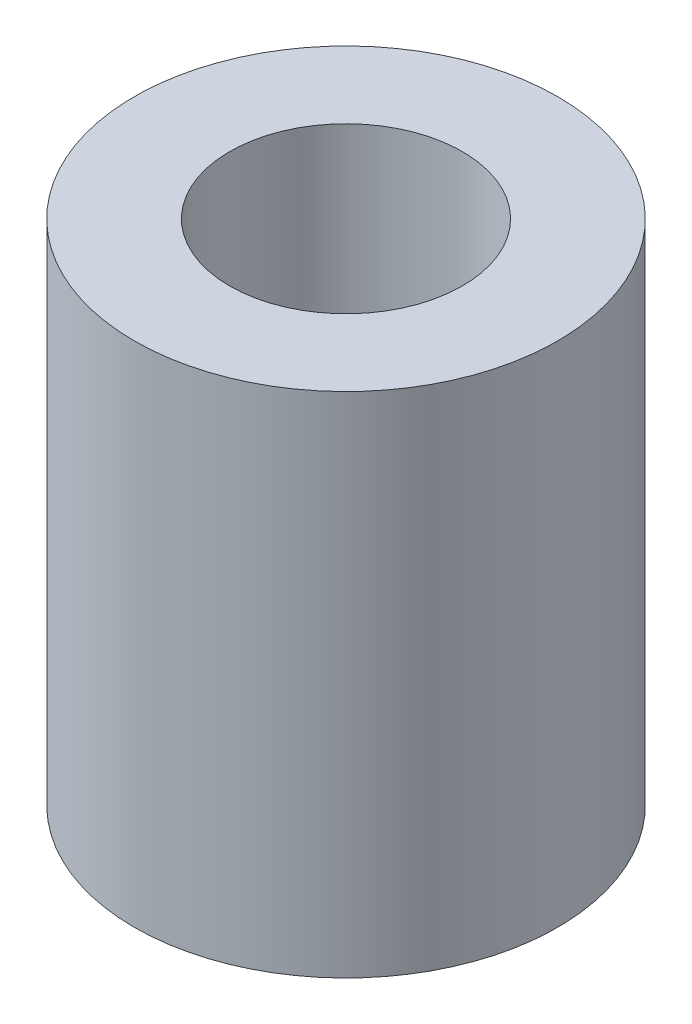
ISO-10303-21;
HEADER;
FILE_DESCRIPTION(('STEP AP214'),'2;1');
FILE_NAME('part.step','',(''),(''),'','','');
FILE_SCHEMA(('AUTOMOTIVE_DESIGN { 1 0 10303 214 1 1 1 1 }'));
ENDSEC;
DATA;
#1=APPLICATION_CONTEXT('core data for automotive mechanical design processes');
#2=APPLICATION_PROTOCOL_DEFINITION('international standard','automotive_design',2000,#1);
#3=PRODUCT_CONTEXT('',#1,'mechanical');
#4=PRODUCT('Part','Part','',(#3));
#5=PRODUCT_RELATED_PRODUCT_CATEGORY('part','',(#4));
#6=PRODUCT_DEFINITION_FORMATION('','',#4);
#7=PRODUCT_DEFINITION_CONTEXT('part definition',#1,'design');
#8=PRODUCT_DEFINITION('design','',#6,#7);
#9=PRODUCT_DEFINITION_SHAPE('','',#8);
#10=(LENGTH_UNIT() NAMED_UNIT(*) SI_UNIT(.MILLI.,.METRE.));
#11=(NAMED_UNIT(*) PLANE_ANGLE_UNIT() SI_UNIT($,.RADIAN.));
#12=(NAMED_UNIT(*) SI_UNIT($,.STERADIAN.) SOLID_ANGLE_UNIT());
#13=UNCERTAINTY_MEASURE_WITH_UNIT(LENGTH_MEASURE(1.E-05),#10,'distance_accuracy_value','');
#14=(GEOMETRIC_REPRESENTATION_CONTEXT(3) GLOBAL_UNCERTAINTY_ASSIGNED_CONTEXT((#13)) GLOBAL_UNIT_ASSIGNED_CONTEXT((#10,
#11,#12)) REPRESENTATION_CONTEXT('',''));
#15=CARTESIAN_POINT('',(0.,0.,0.));
#16=DIRECTION('',(0.,0.,1.));
#17=DIRECTION('',(1.,0.,0.));
#18=AXIS2_PLACEMENT_3D('',#15,#16,#17);
#19=CARTESIAN_POINT('',(0.,12.,0.));
#20=DIRECTION('',(0.,-1.,0.));
#21=DIRECTION('',(0.,0.,-1.));
#22=AXIS2_PLACEMENT_3D('',#19,#20,#21);
#23=CYLINDRICAL_SURFACE('',#22,5.);
#24=CARTESIAN_POINT('',(0.,12.,0.));
#25=DIRECTION('',(0.,1.,0.));
#26=DIRECTION('',(0.,0.,1.));
#27=AXIS2_PLACEMENT_3D('',#24,#25,#26);
#28=CIRCLE('',#27,5.);
#29=CARTESIAN_POINT('',(0.,12.,5.));
#30=VERTEX_POINT('',#29);
#31=EDGE_CURVE('E10',#30,#30,#28,.T.);
#32=ORIENTED_EDGE('',*,*,#31,.F.);
#33=EDGE_LOOP('',(#32));
#34=FACE_BOUND('',#33,.T.);
#35=CARTESIAN_POINT('',(0.,0.,0.));
#36=DIRECTION('',(0.,1.,0.));
#37=DIRECTION('',(0.,0.,1.));
#38=AXIS2_PLACEMENT_3D('',#35,#36,#37);
#39=CIRCLE('',#38,5.);
#40=CARTESIAN_POINT('',(0.,0.,5.));
#41=VERTEX_POINT('',#40);
#42=EDGE_CURVE('E32',#41,#41,#39,.T.);
#43=ORIENTED_EDGE('',*,*,#42,.T.);
#44=EDGE_LOOP('',(#43));
#45=FACE_BOUND('',#44,.T.);
#46=ADVANCED_FACE('F29',(#34,#45),#23,.T.);
#47=CARTESIAN_POINT('',(0.,12.,0.));
#48=DIRECTION('',(0.,1.,0.));
#49=DIRECTION('',(0.,0.,1.));
#50=AXIS2_PLACEMENT_3D('',#47,#48,#49);
#51=PLANE('',#50);
#52=CARTESIAN_POINT('',(0.,12.,0.));
#53=DIRECTION('',(0.,1.,0.));
#54=DIRECTION('',(0.,0.,1.));
#55=AXIS2_PLACEMENT_3D('',#52,#53,#54);
#56=CIRCLE('',#55,2.75);
#57=CARTESIAN_POINT('',(0.,12.,2.75));
#58=VERTEX_POINT('',#57);
#59=EDGE_CURVE('E41',#58,#58,#56,.T.);
#60=ORIENTED_EDGE('',*,*,#59,.F.);
#61=EDGE_LOOP('',(#60));
#62=FACE_BOUND('',#61,.T.);
#63=ORIENTED_EDGE('',*,*,#31,.T.);
#64=EDGE_LOOP('',(#63));
#65=FACE_BOUND('',#64,.T.);
#66=ADVANCED_FACE('F56',(#62,#65),#51,.T.);
#67=CARTESIAN_POINT('',(0.,0.,0.));
#68=DIRECTION('',(0.,1.,0.));
#69=DIRECTION('',(0.,0.,1.));
#70=AXIS2_PLACEMENT_3D('',#67,#68,#69);
#71=PLANE('',#70);
#72=CARTESIAN_POINT('',(0.,0.,0.));
#73=DIRECTION('',(0.,1.,0.));
#74=DIRECTION('',(0.,0.,1.));
#75=AXIS2_PLACEMENT_3D('',#72,#73,#74);
#76=CIRCLE('',#75,2.75);
#77=CARTESIAN_POINT('',(0.,0.,2.75));
#78=VERTEX_POINT('',#77);
#79=EDGE_CURVE('E39',#78,#78,#76,.T.);
#80=ORIENTED_EDGE('',*,*,#79,.T.);
#81=EDGE_LOOP('',(#80));
#82=FACE_BOUND('',#81,.T.);
#83=ORIENTED_EDGE('',*,*,#42,.F.);
#84=EDGE_LOOP('',(#83));
#85=FACE_BOUND('',#84,.T.);
#86=ADVANCED_FACE('F47',(#82,#85),#71,.F.);
#87=CARTESIAN_POINT('',(0.,0.,0.));
#88=DIRECTION('',(0.,1.,0.));
#89=DIRECTION('',(0.,0.,1.));
#90=AXIS2_PLACEMENT_3D('',#87,#88,#89);
#91=CYLINDRICAL_SURFACE('',#90,2.75);
#92=ORIENTED_EDGE('',*,*,#79,.F.);
#93=EDGE_LOOP('',(#92));
#94=FACE_BOUND('',#93,.T.);
#95=ORIENTED_EDGE('',*,*,#59,.T.);
#96=EDGE_LOOP('',(#95));
#97=FACE_BOUND('',#96,.T.);
#98=ADVANCED_FACE('F50',(#94,#97),#91,.F.);
#99=CLOSED_SHELL('',(#46,#66,#86,#98));
#100=MANIFOLD_SOLID_BREP('B2',#99);
#101=ADVANCED_BREP_SHAPE_REPRESENTATION('',(#18,#100),#14);
#102=SHAPE_DEFINITION_REPRESENTATION(#9,#101);
ENDSEC;
END-ISO-10303-21;
